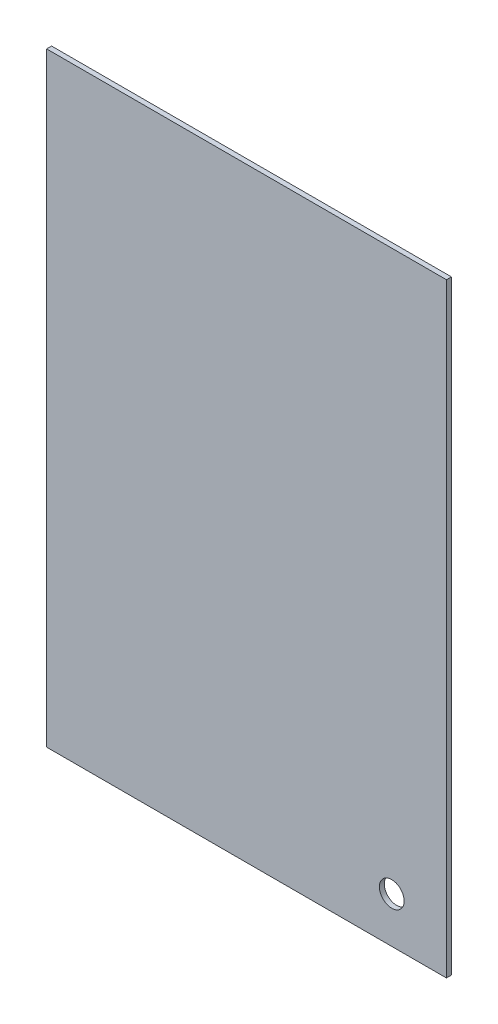
ISO-10303-21;
HEADER;
FILE_DESCRIPTION(('STEP AP214'),'2;1');
FILE_NAME('part.step','',(''),(''),'','','');
FILE_SCHEMA(('AUTOMOTIVE_DESIGN { 1 0 10303 214 1 1 1 1 }'));
ENDSEC;
DATA;
#1=APPLICATION_CONTEXT('core data for automotive mechanical design processes');
#2=APPLICATION_PROTOCOL_DEFINITION('international standard','automotive_design',2000,#1);
#3=PRODUCT_CONTEXT('',#1,'mechanical');
#4=PRODUCT('Part','Part','',(#3));
#5=PRODUCT_RELATED_PRODUCT_CATEGORY('part','',(#4));
#6=PRODUCT_DEFINITION_FORMATION('','',#4);
#7=PRODUCT_DEFINITION_CONTEXT('part definition',#1,'design');
#8=PRODUCT_DEFINITION('design','',#6,#7);
#9=PRODUCT_DEFINITION_SHAPE('','',#8);
#10=(LENGTH_UNIT() NAMED_UNIT(*) SI_UNIT(.MILLI.,.METRE.));
#11=(NAMED_UNIT(*) PLANE_ANGLE_UNIT() SI_UNIT($,.RADIAN.));
#12=(NAMED_UNIT(*) SI_UNIT($,.STERADIAN.) SOLID_ANGLE_UNIT());
#13=UNCERTAINTY_MEASURE_WITH_UNIT(LENGTH_MEASURE(1.E-05),#10,'distance_accuracy_value','');
#14=(GEOMETRIC_REPRESENTATION_CONTEXT(3) GLOBAL_UNCERTAINTY_ASSIGNED_CONTEXT((#13)) GLOBAL_UNIT_ASSIGNED_CONTEXT((#10,
#11,#12)) REPRESENTATION_CONTEXT('',''));
#15=CARTESIAN_POINT('',(0.,0.,0.));
#16=DIRECTION('',(0.,0.,1.));
#17=DIRECTION('',(1.,0.,0.));
#18=AXIS2_PLACEMENT_3D('',#15,#16,#17);
#19=CARTESIAN_POINT('',(121.,183.,3.));
#20=DIRECTION('',(-1.,0.,0.));
#21=DIRECTION('',(0.,-1.,0.));
#22=AXIS2_PLACEMENT_3D('',#19,#20,#21);
#23=PLANE('',#22);
#24=DIRECTION('',(0.,1.,0.));
#25=VECTOR('',#24,1.);
#26=CARTESIAN_POINT('',(121.,183.,0.));
#27=LINE('',#26,#25);
#28=CARTESIAN_POINT('',(121.,-183.,0.));
#29=VERTEX_POINT('',#28);
#30=CARTESIAN_POINT('',(121.,183.,0.));
#31=VERTEX_POINT('',#30);
#32=EDGE_CURVE('E104',#29,#31,#27,.T.);
#33=ORIENTED_EDGE('',*,*,#32,.T.);
#34=DIRECTION('',(0.,0.,-1.));
#35=VECTOR('',#34,1.);
#36=CARTESIAN_POINT('',(121.,183.,3.));
#37=LINE('',#36,#35);
#38=CARTESIAN_POINT('',(121.,183.,3.));
#39=VERTEX_POINT('',#38);
#40=EDGE_CURVE('E11',#39,#31,#37,.T.);
#41=ORIENTED_EDGE('',*,*,#40,.F.);
#42=DIRECTION('',(0.,1.,0.));
#43=VECTOR('',#42,1.);
#44=CARTESIAN_POINT('',(121.,183.,3.));
#45=LINE('',#44,#43);
#46=CARTESIAN_POINT('',(121.,-183.,3.));
#47=VERTEX_POINT('',#46);
#48=EDGE_CURVE('E92',#47,#39,#45,.T.);
#49=ORIENTED_EDGE('',*,*,#48,.F.);
#50=DIRECTION('',(0.,0.,-1.));
#51=VECTOR('',#50,1.);
#52=CARTESIAN_POINT('',(121.,-183.,3.));
#53=LINE('',#52,#51);
#54=EDGE_CURVE('E100',#47,#29,#53,.T.);
#55=ORIENTED_EDGE('',*,*,#54,.T.);
#56=EDGE_LOOP('',(#33,#41,#49,#55));
#57=FACE_BOUND('',#56,.T.);
#58=ADVANCED_FACE('F41',(#57),#23,.F.);
#59=CARTESIAN_POINT('',(-121.,183.,3.));
#60=DIRECTION('',(0.,-1.,0.));
#61=DIRECTION('',(0.,0.,-1.));
#62=AXIS2_PLACEMENT_3D('',#59,#60,#61);
#63=PLANE('',#62);
#64=DIRECTION('',(-1.,0.,0.));
#65=VECTOR('',#64,1.);
#66=CARTESIAN_POINT('',(-121.,183.,0.));
#67=LINE('',#66,#65);
#68=CARTESIAN_POINT('',(-121.,183.,0.));
#69=VERTEX_POINT('',#68);
#70=EDGE_CURVE('E96',#31,#69,#67,.T.);
#71=ORIENTED_EDGE('',*,*,#70,.T.);
#72=DIRECTION('',(0.,0.,-1.));
#73=VECTOR('',#72,1.);
#74=CARTESIAN_POINT('',(-121.,183.,3.));
#75=LINE('',#74,#73);
#76=CARTESIAN_POINT('',(-121.,183.,3.));
#77=VERTEX_POINT('',#76);
#78=EDGE_CURVE('E49',#77,#69,#75,.T.);
#79=ORIENTED_EDGE('',*,*,#78,.F.);
#80=DIRECTION('',(-1.,0.,0.));
#81=VECTOR('',#80,1.);
#82=CARTESIAN_POINT('',(-121.,183.,3.));
#83=LINE('',#82,#81);
#84=EDGE_CURVE('E87',#39,#77,#83,.T.);
#85=ORIENTED_EDGE('',*,*,#84,.F.);
#86=ORIENTED_EDGE('',*,*,#40,.T.);
#87=EDGE_LOOP('',(#71,#79,#85,#86));
#88=FACE_BOUND('',#87,.T.);
#89=ADVANCED_FACE('F95',(#88),#63,.F.);
#90=CARTESIAN_POINT('',(-121.,183.,3.));
#91=DIRECTION('',(1.,0.,0.));
#92=DIRECTION('',(0.,1.,0.));
#93=AXIS2_PLACEMENT_3D('',#90,#91,#92);
#94=PLANE('',#93);
#95=DIRECTION('',(0.,-1.,0.));
#96=VECTOR('',#95,1.);
#97=CARTESIAN_POINT('',(-121.,183.,0.));
#98=LINE('',#97,#96);
#99=CARTESIAN_POINT('',(-121.,-183.,0.));
#100=VERTEX_POINT('',#99);
#101=EDGE_CURVE('E74',#69,#100,#98,.T.);
#102=ORIENTED_EDGE('',*,*,#101,.T.);
#103=DIRECTION('',(0.,0.,-1.));
#104=VECTOR('',#103,1.);
#105=CARTESIAN_POINT('',(-121.,-183.,3.));
#106=LINE('',#105,#104);
#107=CARTESIAN_POINT('',(-121.,-183.,3.));
#108=VERTEX_POINT('',#107);
#109=EDGE_CURVE('E97',#108,#100,#106,.T.);
#110=ORIENTED_EDGE('',*,*,#109,.F.);
#111=DIRECTION('',(0.,-1.,0.));
#112=VECTOR('',#111,1.);
#113=CARTESIAN_POINT('',(-121.,183.,3.));
#114=LINE('',#113,#112);
#115=EDGE_CURVE('E90',#77,#108,#114,.T.);
#116=ORIENTED_EDGE('',*,*,#115,.F.);
#117=ORIENTED_EDGE('',*,*,#78,.T.);
#118=EDGE_LOOP('',(#102,#110,#116,#117));
#119=FACE_BOUND('',#118,.T.);
#120=ADVANCED_FACE('F98',(#119),#94,.F.);
#121=CARTESIAN_POINT('',(-121.,-183.,3.));
#122=DIRECTION('',(0.,1.,0.));
#123=DIRECTION('',(0.,0.,1.));
#124=AXIS2_PLACEMENT_3D('',#121,#122,#123);
#125=PLANE('',#124);
#126=DIRECTION('',(1.,0.,0.));
#127=VECTOR('',#126,1.);
#128=CARTESIAN_POINT('',(-121.,-183.,0.));
#129=LINE('',#128,#127);
#130=EDGE_CURVE('E80',#100,#29,#129,.T.);
#131=ORIENTED_EDGE('',*,*,#130,.T.);
#132=ORIENTED_EDGE('',*,*,#54,.F.);
#133=DIRECTION('',(1.,0.,0.));
#134=VECTOR('',#133,1.);
#135=CARTESIAN_POINT('',(-121.,-183.,3.));
#136=LINE('',#135,#134);
#137=EDGE_CURVE('E57',#108,#47,#136,.T.);
#138=ORIENTED_EDGE('',*,*,#137,.F.);
#139=ORIENTED_EDGE('',*,*,#109,.T.);
#140=EDGE_LOOP('',(#131,#132,#138,#139));
#141=FACE_BOUND('',#140,.T.);
#142=ADVANCED_FACE('F112',(#141),#125,.F.);
#143=CARTESIAN_POINT('',(0.,0.,3.));
#144=DIRECTION('',(0.,0.,1.));
#145=DIRECTION('',(1.,0.,0.));
#146=AXIS2_PLACEMENT_3D('',#143,#144,#145);
#147=PLANE('',#146);
#148=CARTESIAN_POINT('',(87.9,-155.5,3.));
#149=DIRECTION('',(0.,0.,1.));
#150=DIRECTION('',(1.,0.,0.));
#151=AXIS2_PLACEMENT_3D('',#148,#149,#150);
#152=CIRCLE('',#151,7.50000000000001);
#153=CARTESIAN_POINT('',(95.4,-155.5,3.));
#154=VERTEX_POINT('',#153);
#155=EDGE_CURVE('E120',#154,#154,#152,.T.);
#156=ORIENTED_EDGE('',*,*,#155,.F.);
#157=EDGE_LOOP('',(#156));
#158=FACE_BOUND('',#157,.T.);
#159=ORIENTED_EDGE('',*,*,#48,.T.);
#160=ORIENTED_EDGE('',*,*,#84,.T.);
#161=ORIENTED_EDGE('',*,*,#115,.T.);
#162=ORIENTED_EDGE('',*,*,#137,.T.);
#163=EDGE_LOOP('',(#159,#160,#161,#162));
#164=FACE_BOUND('',#163,.T.);
#165=ADVANCED_FACE('F88',(#158,#164),#147,.T.);
#166=CARTESIAN_POINT('',(0.,0.,0.));
#167=DIRECTION('',(0.,0.,1.));
#168=DIRECTION('',(1.,0.,0.));
#169=AXIS2_PLACEMENT_3D('',#166,#167,#168);
#170=PLANE('',#169);
#171=CARTESIAN_POINT('',(87.9,-155.5,0.));
#172=DIRECTION('',(0.,0.,1.));
#173=DIRECTION('',(1.,0.,0.));
#174=AXIS2_PLACEMENT_3D('',#171,#172,#173);
#175=CIRCLE('',#174,7.50000000000001);
#176=CARTESIAN_POINT('',(95.4,-155.5,0.));
#177=VERTEX_POINT('',#176);
#178=EDGE_CURVE('E107',#177,#177,#175,.F.);
#179=ORIENTED_EDGE('',*,*,#178,.F.);
#180=EDGE_LOOP('',(#179));
#181=FACE_BOUND('',#180,.T.);
#182=ORIENTED_EDGE('',*,*,#32,.F.);
#183=ORIENTED_EDGE('',*,*,#130,.F.);
#184=ORIENTED_EDGE('',*,*,#101,.F.);
#185=ORIENTED_EDGE('',*,*,#70,.F.);
#186=EDGE_LOOP('',(#182,#183,#184,#185));
#187=FACE_BOUND('',#186,.T.);
#188=ADVANCED_FACE('F115',(#181,#187),#170,.F.);
#189=CARTESIAN_POINT('',(87.9,-155.5,-0.00100000000000013));
#190=DIRECTION('',(0.,0.,1.));
#191=DIRECTION('',(1.,0.,0.));
#192=AXIS2_PLACEMENT_3D('',#189,#190,#191);
#193=CYLINDRICAL_SURFACE('',#192,7.50000000000001);
#194=ORIENTED_EDGE('',*,*,#155,.T.);
#195=EDGE_LOOP('',(#194));
#196=FACE_BOUND('',#195,.T.);
#197=ORIENTED_EDGE('',*,*,#178,.T.);
#198=EDGE_LOOP('',(#197));
#199=FACE_BOUND('',#198,.T.);
#200=ADVANCED_FACE('F124',(#196,#199),#193,.F.);
#201=CLOSED_SHELL('',(#58,#89,#120,#142,#165,#188,#200));
#202=MANIFOLD_SOLID_BREP('B2',#201);
#203=ADVANCED_BREP_SHAPE_REPRESENTATION('',(#18,#202),#14);
#204=SHAPE_DEFINITION_REPRESENTATION(#9,#203);
ENDSEC;
END-ISO-10303-21;
